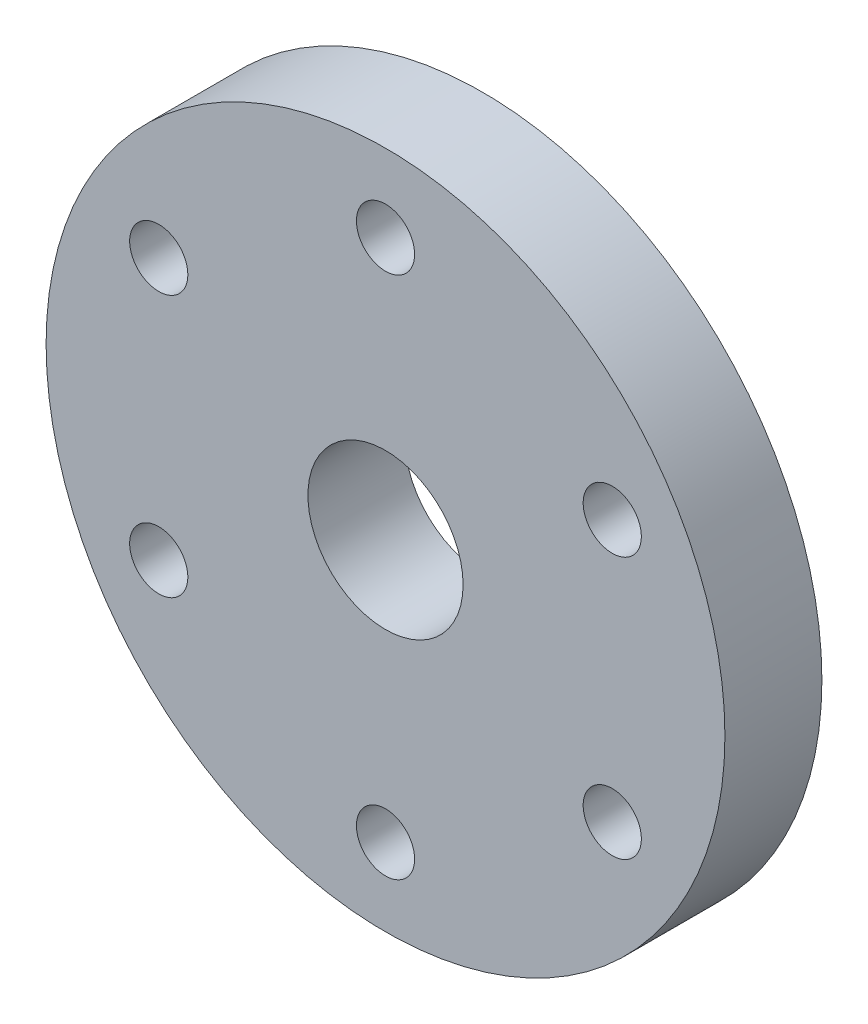
ISO-10303-21;
HEADER;
FILE_DESCRIPTION(('STEP AP214'),'2;1');
FILE_NAME('part.step','',(''),(''),'','','');
FILE_SCHEMA(('AUTOMOTIVE_DESIGN { 1 0 10303 214 1 1 1 1 }'));
ENDSEC;
DATA;
#1=APPLICATION_CONTEXT('core data for automotive mechanical design processes');
#2=APPLICATION_PROTOCOL_DEFINITION('international standard','automotive_design',2000,#1);
#3=PRODUCT_CONTEXT('',#1,'mechanical');
#4=PRODUCT('Part','Part','',(#3));
#5=PRODUCT_RELATED_PRODUCT_CATEGORY('part','',(#4));
#6=PRODUCT_DEFINITION_FORMATION('','',#4);
#7=PRODUCT_DEFINITION_CONTEXT('part definition',#1,'design');
#8=PRODUCT_DEFINITION('design','',#6,#7);
#9=PRODUCT_DEFINITION_SHAPE('','',#8);
#10=(LENGTH_UNIT() NAMED_UNIT(*) SI_UNIT(.MILLI.,.METRE.));
#11=(NAMED_UNIT(*) PLANE_ANGLE_UNIT() SI_UNIT($,.RADIAN.));
#12=(NAMED_UNIT(*) SI_UNIT($,.STERADIAN.) SOLID_ANGLE_UNIT());
#13=UNCERTAINTY_MEASURE_WITH_UNIT(LENGTH_MEASURE(1.E-05),#10,'distance_accuracy_value','');
#14=(GEOMETRIC_REPRESENTATION_CONTEXT(3) GLOBAL_UNCERTAINTY_ASSIGNED_CONTEXT((#13)) GLOBAL_UNIT_ASSIGNED_CONTEXT((#10,
#11,#12)) REPRESENTATION_CONTEXT('',''));
#15=CARTESIAN_POINT('',(0.,0.,0.));
#16=DIRECTION('',(0.,0.,1.));
#17=DIRECTION('',(1.,0.,0.));
#18=AXIS2_PLACEMENT_3D('',#15,#16,#17);
#19=CARTESIAN_POINT('',(0.,0.,5.));
#20=DIRECTION('',(0.,0.,-1.));
#21=DIRECTION('',(-1.,0.,0.));
#22=AXIS2_PLACEMENT_3D('',#19,#20,#21);
#23=CYLINDRICAL_SURFACE('',#22,17.5);
#24=CARTESIAN_POINT('',(0.,0.,5.));
#25=DIRECTION('',(0.,0.,1.));
#26=DIRECTION('',(1.,0.,0.));
#27=AXIS2_PLACEMENT_3D('',#24,#25,#26);
#28=CIRCLE('',#27,17.5);
#29=CARTESIAN_POINT('',(17.5,0.,5.));
#30=VERTEX_POINT('',#29);
#31=EDGE_CURVE('E10',#30,#30,#28,.T.);
#32=ORIENTED_EDGE('',*,*,#31,.F.);
#33=EDGE_LOOP('',(#32));
#34=FACE_BOUND('',#33,.T.);
#35=CARTESIAN_POINT('',(0.,0.,0.));
#36=DIRECTION('',(0.,0.,1.));
#37=DIRECTION('',(1.,0.,0.));
#38=AXIS2_PLACEMENT_3D('',#35,#36,#37);
#39=CIRCLE('',#38,17.5);
#40=CARTESIAN_POINT('',(17.5,0.,0.));
#41=VERTEX_POINT('',#40);
#42=EDGE_CURVE('E35',#41,#41,#39,.T.);
#43=ORIENTED_EDGE('',*,*,#42,.T.);
#44=EDGE_LOOP('',(#43));
#45=FACE_BOUND('',#44,.T.);
#46=ADVANCED_FACE('F32',(#34,#45),#23,.T.);
#47=CARTESIAN_POINT('',(0.,0.,5.));
#48=DIRECTION('',(0.,0.,1.));
#49=DIRECTION('',(1.,0.,0.));
#50=AXIS2_PLACEMENT_3D('',#47,#48,#49);
#51=PLANE('',#50);
#52=CARTESIAN_POINT('',(0.,13.5,5.));
#53=DIRECTION('',(0.,0.,1.));
#54=DIRECTION('',(1.,0.,0.));
#55=AXIS2_PLACEMENT_3D('',#52,#53,#54);
#56=CIRCLE('',#55,1.5);
#57=CARTESIAN_POINT('',(1.5,13.5,5.));
#58=VERTEX_POINT('',#57);
#59=EDGE_CURVE('E69',#58,#58,#56,.T.);
#60=ORIENTED_EDGE('',*,*,#59,.F.);
#61=EDGE_LOOP('',(#60));
#62=FACE_BOUND('',#61,.T.);
#63=CARTESIAN_POINT('',(-11.6913429510894,6.74999999999916,5.));
#64=DIRECTION('',(0.,0.,1.));
#65=DIRECTION('',(1.,0.,0.));
#66=AXIS2_PLACEMENT_3D('',#63,#64,#65);
#67=CIRCLE('',#66,1.50000000000086);
#68=CARTESIAN_POINT('',(-10.1913429510886,6.74999999999916,5.));
#69=VERTEX_POINT('',#68);
#70=EDGE_CURVE('E73',#69,#69,#67,.T.);
#71=ORIENTED_EDGE('',*,*,#70,.F.);
#72=EDGE_LOOP('',(#71));
#73=FACE_BOUND('',#72,.T.);
#74=CARTESIAN_POINT('',(1.91350556701572E-12,-13.5,5.));
#75=DIRECTION('',(0.,0.,1.));
#76=DIRECTION('',(1.,0.,0.));
#77=AXIS2_PLACEMENT_3D('',#74,#75,#76);
#78=CIRCLE('',#77,1.50000000000192);
#79=CARTESIAN_POINT('',(1.50000000000383,-13.5,5.));
#80=VERTEX_POINT('',#79);
#81=EDGE_CURVE('E48',#80,#80,#78,.T.);
#82=ORIENTED_EDGE('',*,*,#81,.F.);
#83=EDGE_LOOP('',(#82));
#84=FACE_BOUND('',#83,.T.);
#85=CARTESIAN_POINT('',(-11.6913429510885,-6.75000000000083,5.));
#86=DIRECTION('',(0.,0.,1.));
#87=DIRECTION('',(1.,0.,0.));
#88=AXIS2_PLACEMENT_3D('',#85,#86,#87);
#89=CIRCLE('',#88,1.50000000000174);
#90=CARTESIAN_POINT('',(-10.1913429510867,-6.75000000000083,5.));
#91=VERTEX_POINT('',#90);
#92=EDGE_CURVE('E47',#91,#91,#89,.T.);
#93=ORIENTED_EDGE('',*,*,#92,.F.);
#94=EDGE_LOOP('',(#93));
#95=FACE_BOUND('',#94,.T.);
#96=CARTESIAN_POINT('',(0.,0.,5.));
#97=DIRECTION('',(0.,0.,1.));
#98=DIRECTION('',(1.,0.,0.));
#99=AXIS2_PLACEMENT_3D('',#96,#97,#98);
#100=CIRCLE('',#99,4.);
#101=CARTESIAN_POINT('',(4.,0.,5.));
#102=VERTEX_POINT('',#101);
#103=EDGE_CURVE('E54',#102,#102,#100,.T.);
#104=ORIENTED_EDGE('',*,*,#103,.F.);
#105=EDGE_LOOP('',(#104));
#106=FACE_BOUND('',#105,.T.);
#107=CARTESIAN_POINT('',(11.6913429510914,-6.74999999999917,5.));
#108=DIRECTION('',(0.,0.,1.));
#109=DIRECTION('',(1.,0.,0.));
#110=AXIS2_PLACEMENT_3D('',#107,#108,#109);
#111=CIRCLE('',#110,1.50000000000131);
#112=CARTESIAN_POINT('',(13.1913429510927,-6.74999999999917,5.));
#113=VERTEX_POINT('',#112);
#114=EDGE_CURVE('E60',#113,#113,#111,.T.);
#115=ORIENTED_EDGE('',*,*,#114,.F.);
#116=EDGE_LOOP('',(#115));
#117=FACE_BOUND('',#116,.T.);
#118=CARTESIAN_POINT('',(11.6913429510904,6.75000000000083,5.));
#119=DIRECTION('',(0.,0.,1.));
#120=DIRECTION('',(1.,0.,0.));
#121=AXIS2_PLACEMENT_3D('',#118,#119,#120);
#122=CIRCLE('',#121,1.5000000000005);
#123=CARTESIAN_POINT('',(13.1913429510909,6.75000000000083,5.));
#124=VERTEX_POINT('',#123);
#125=EDGE_CURVE('E66',#124,#124,#122,.T.);
#126=ORIENTED_EDGE('',*,*,#125,.F.);
#127=EDGE_LOOP('',(#126));
#128=FACE_BOUND('',#127,.T.);
#129=ORIENTED_EDGE('',*,*,#31,.T.);
#130=EDGE_LOOP('',(#129));
#131=FACE_BOUND('',#130,.T.);
#132=ADVANCED_FACE('F96',(#62,#73,#84,#95,#106,#117,#128,#131),#51,.T.);
#133=CARTESIAN_POINT('',(0.,0.,0.));
#134=DIRECTION('',(0.,0.,1.));
#135=DIRECTION('',(1.,0.,0.));
#136=AXIS2_PLACEMENT_3D('',#133,#134,#135);
#137=PLANE('',#136);
#138=CARTESIAN_POINT('',(0.,13.5,0.));
#139=DIRECTION('',(0.,0.,1.));
#140=DIRECTION('',(1.,0.,0.));
#141=AXIS2_PLACEMENT_3D('',#138,#139,#140);
#142=CIRCLE('',#141,1.5);
#143=CARTESIAN_POINT('',(1.5,13.5,0.));
#144=VERTEX_POINT('',#143);
#145=EDGE_CURVE('E42',#144,#144,#142,.T.);
#146=ORIENTED_EDGE('',*,*,#145,.T.);
#147=EDGE_LOOP('',(#146));
#148=FACE_BOUND('',#147,.T.);
#149=CARTESIAN_POINT('',(-11.6913429510894,6.74999999999916,0.));
#150=DIRECTION('',(0.,0.,1.));
#151=DIRECTION('',(1.,0.,0.));
#152=AXIS2_PLACEMENT_3D('',#149,#150,#151);
#153=CIRCLE('',#152,1.50000000000086);
#154=CARTESIAN_POINT('',(-10.1913429510886,6.74999999999916,0.));
#155=VERTEX_POINT('',#154);
#156=EDGE_CURVE('E70',#155,#155,#153,.T.);
#157=ORIENTED_EDGE('',*,*,#156,.T.);
#158=EDGE_LOOP('',(#157));
#159=FACE_BOUND('',#158,.T.);
#160=CARTESIAN_POINT('',(1.91350556701572E-12,-13.5,0.));
#161=DIRECTION('',(0.,0.,1.));
#162=DIRECTION('',(1.,0.,0.));
#163=AXIS2_PLACEMENT_3D('',#160,#161,#162);
#164=CIRCLE('',#163,1.50000000000192);
#165=CARTESIAN_POINT('',(1.50000000000383,-13.5,0.));
#166=VERTEX_POINT('',#165);
#167=EDGE_CURVE('E76',#166,#166,#164,.T.);
#168=ORIENTED_EDGE('',*,*,#167,.T.);
#169=EDGE_LOOP('',(#168));
#170=FACE_BOUND('',#169,.T.);
#171=CARTESIAN_POINT('',(-11.6913429510885,-6.75000000000083,0.));
#172=DIRECTION('',(0.,0.,1.));
#173=DIRECTION('',(1.,0.,0.));
#174=AXIS2_PLACEMENT_3D('',#171,#172,#173);
#175=CIRCLE('',#174,1.50000000000174);
#176=CARTESIAN_POINT('',(-10.1913429510867,-6.75000000000083,0.));
#177=VERTEX_POINT('',#176);
#178=EDGE_CURVE('E44',#177,#177,#175,.T.);
#179=ORIENTED_EDGE('',*,*,#178,.T.);
#180=EDGE_LOOP('',(#179));
#181=FACE_BOUND('',#180,.T.);
#182=CARTESIAN_POINT('',(0.,0.,0.));
#183=DIRECTION('',(0.,0.,1.));
#184=DIRECTION('',(1.,0.,0.));
#185=AXIS2_PLACEMENT_3D('',#182,#183,#184);
#186=CIRCLE('',#185,4.);
#187=CARTESIAN_POINT('',(4.,0.,0.));
#188=VERTEX_POINT('',#187);
#189=EDGE_CURVE('E51',#188,#188,#186,.T.);
#190=ORIENTED_EDGE('',*,*,#189,.T.);
#191=EDGE_LOOP('',(#190));
#192=FACE_BOUND('',#191,.T.);
#193=CARTESIAN_POINT('',(11.6913429510914,-6.74999999999917,0.));
#194=DIRECTION('',(0.,0.,1.));
#195=DIRECTION('',(1.,0.,0.));
#196=AXIS2_PLACEMENT_3D('',#193,#194,#195);
#197=CIRCLE('',#196,1.50000000000131);
#198=CARTESIAN_POINT('',(13.1913429510927,-6.74999999999917,0.));
#199=VERTEX_POINT('',#198);
#200=EDGE_CURVE('E57',#199,#199,#197,.T.);
#201=ORIENTED_EDGE('',*,*,#200,.T.);
#202=EDGE_LOOP('',(#201));
#203=FACE_BOUND('',#202,.T.);
#204=CARTESIAN_POINT('',(11.6913429510904,6.75000000000083,0.));
#205=DIRECTION('',(0.,0.,1.));
#206=DIRECTION('',(1.,0.,0.));
#207=AXIS2_PLACEMENT_3D('',#204,#205,#206);
#208=CIRCLE('',#207,1.5000000000005);
#209=CARTESIAN_POINT('',(13.1913429510909,6.75000000000083,0.));
#210=VERTEX_POINT('',#209);
#211=EDGE_CURVE('E63',#210,#210,#208,.T.);
#212=ORIENTED_EDGE('',*,*,#211,.T.);
#213=EDGE_LOOP('',(#212));
#214=FACE_BOUND('',#213,.T.);
#215=ORIENTED_EDGE('',*,*,#42,.F.);
#216=EDGE_LOOP('',(#215));
#217=FACE_BOUND('',#216,.T.);
#218=ADVANCED_FACE('F86',(#148,#159,#170,#181,#192,#203,#214,#217),#137,.F.);
#219=CARTESIAN_POINT('',(11.6913429510904,6.75000000000083,0.));
#220=DIRECTION('',(0.,0.,1.));
#221=DIRECTION('',(1.,0.,0.));
#222=AXIS2_PLACEMENT_3D('',#219,#220,#221);
#223=CYLINDRICAL_SURFACE('',#222,1.5000000000005);
#224=ORIENTED_EDGE('',*,*,#211,.F.);
#225=EDGE_LOOP('',(#224));
#226=FACE_BOUND('',#225,.T.);
#227=ORIENTED_EDGE('',*,*,#125,.T.);
#228=EDGE_LOOP('',(#227));
#229=FACE_BOUND('',#228,.T.);
#230=ADVANCED_FACE('F112',(#226,#229),#223,.F.);
#231=CARTESIAN_POINT('',(11.6913429510914,-6.74999999999917,0.));
#232=DIRECTION('',(0.,0.,1.));
#233=DIRECTION('',(1.,0.,0.));
#234=AXIS2_PLACEMENT_3D('',#231,#232,#233);
#235=CYLINDRICAL_SURFACE('',#234,1.50000000000131);
#236=ORIENTED_EDGE('',*,*,#200,.F.);
#237=EDGE_LOOP('',(#236));
#238=FACE_BOUND('',#237,.T.);
#239=ORIENTED_EDGE('',*,*,#114,.T.);
#240=EDGE_LOOP('',(#239));
#241=FACE_BOUND('',#240,.T.);
#242=ADVANCED_FACE('F114',(#238,#241),#235,.F.);
#243=CARTESIAN_POINT('',(0.,0.,0.));
#244=DIRECTION('',(0.,0.,1.));
#245=DIRECTION('',(1.,0.,0.));
#246=AXIS2_PLACEMENT_3D('',#243,#244,#245);
#247=CYLINDRICAL_SURFACE('',#246,4.);
#248=ORIENTED_EDGE('',*,*,#189,.F.);
#249=EDGE_LOOP('',(#248));
#250=FACE_BOUND('',#249,.T.);
#251=ORIENTED_EDGE('',*,*,#103,.T.);
#252=EDGE_LOOP('',(#251));
#253=FACE_BOUND('',#252,.T.);
#254=ADVANCED_FACE('F121',(#250,#253),#247,.F.);
#255=CARTESIAN_POINT('',(-11.6913429510885,-6.75000000000083,0.));
#256=DIRECTION('',(0.,0.,1.));
#257=DIRECTION('',(1.,0.,0.));
#258=AXIS2_PLACEMENT_3D('',#255,#256,#257);
#259=CYLINDRICAL_SURFACE('',#258,1.50000000000174);
#260=ORIENTED_EDGE('',*,*,#178,.F.);
#261=EDGE_LOOP('',(#260));
#262=FACE_BOUND('',#261,.T.);
#263=ORIENTED_EDGE('',*,*,#92,.T.);
#264=EDGE_LOOP('',(#263));
#265=FACE_BOUND('',#264,.T.);
#266=ADVANCED_FACE('F160',(#262,#265),#259,.F.);
#267=CARTESIAN_POINT('',(1.91350556701572E-12,-13.5,0.));
#268=DIRECTION('',(0.,0.,1.));
#269=DIRECTION('',(1.,0.,0.));
#270=AXIS2_PLACEMENT_3D('',#267,#268,#269);
#271=CYLINDRICAL_SURFACE('',#270,1.50000000000192);
#272=ORIENTED_EDGE('',*,*,#167,.F.);
#273=EDGE_LOOP('',(#272));
#274=FACE_BOUND('',#273,.T.);
#275=ORIENTED_EDGE('',*,*,#81,.T.);
#276=EDGE_LOOP('',(#275));
#277=FACE_BOUND('',#276,.T.);
#278=ADVANCED_FACE('F170',(#274,#277),#271,.F.);
#279=CARTESIAN_POINT('',(-11.6913429510894,6.74999999999916,0.));
#280=DIRECTION('',(0.,0.,1.));
#281=DIRECTION('',(1.,0.,0.));
#282=AXIS2_PLACEMENT_3D('',#279,#280,#281);
#283=CYLINDRICAL_SURFACE('',#282,1.50000000000086);
#284=ORIENTED_EDGE('',*,*,#156,.F.);
#285=EDGE_LOOP('',(#284));
#286=FACE_BOUND('',#285,.T.);
#287=ORIENTED_EDGE('',*,*,#70,.T.);
#288=EDGE_LOOP('',(#287));
#289=FACE_BOUND('',#288,.T.);
#290=ADVANCED_FACE('F92',(#286,#289),#283,.F.);
#291=CARTESIAN_POINT('',(0.,13.5,0.));
#292=DIRECTION('',(0.,0.,1.));
#293=DIRECTION('',(1.,0.,0.));
#294=AXIS2_PLACEMENT_3D('',#291,#292,#293);
#295=CYLINDRICAL_SURFACE('',#294,1.5);
#296=ORIENTED_EDGE('',*,*,#145,.F.);
#297=EDGE_LOOP('',(#296));
#298=FACE_BOUND('',#297,.T.);
#299=ORIENTED_EDGE('',*,*,#59,.T.);
#300=EDGE_LOOP('',(#299));
#301=FACE_BOUND('',#300,.T.);
#302=ADVANCED_FACE('F89',(#298,#301),#295,.F.);
#303=CLOSED_SHELL('',(#46,#132,#218,#230,#242,#254,#266,#278,#290,#302));
#304=MANIFOLD_SOLID_BREP('B2',#303);
#305=ADVANCED_BREP_SHAPE_REPRESENTATION('',(#18,#304),#14);
#306=SHAPE_DEFINITION_REPRESENTATION(#9,#305);
ENDSEC;
END-ISO-10303-21;
